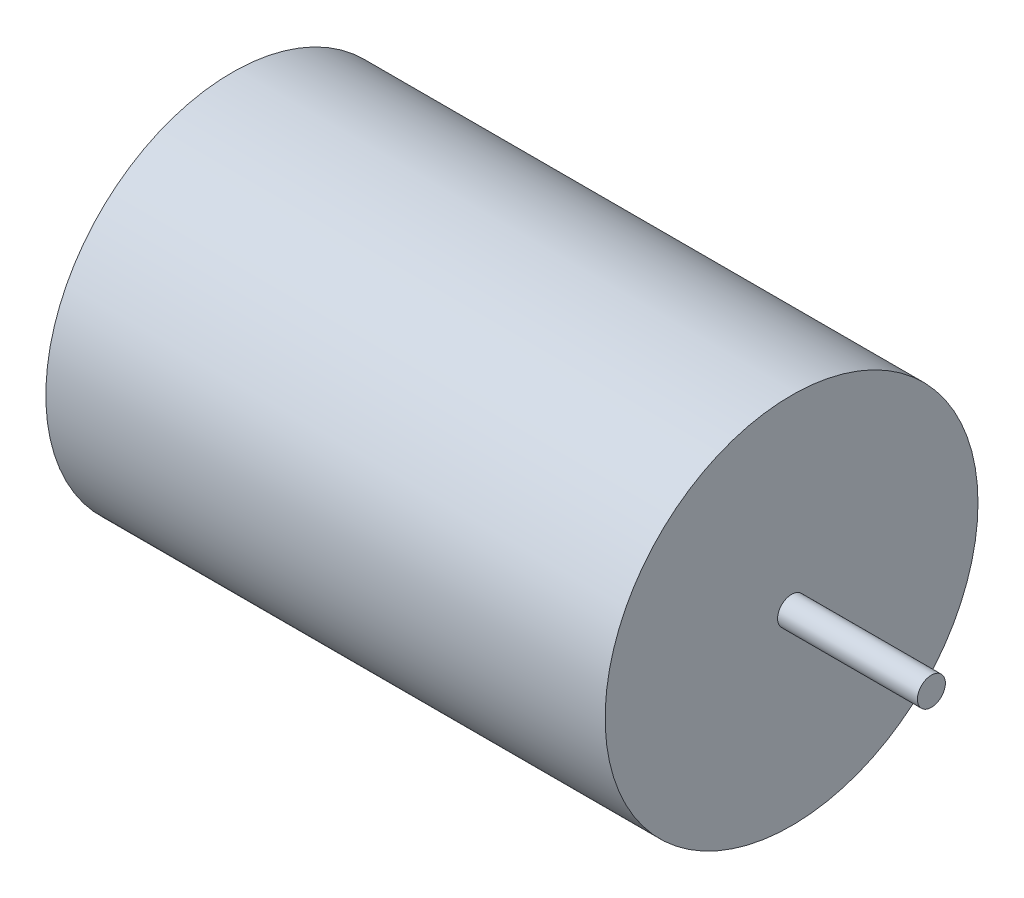
ISO-10303-21;
HEADER;
FILE_DESCRIPTION(('STEP AP214'),'2;1');
FILE_NAME('part.step','',(''),(''),'','','');
FILE_SCHEMA(('AUTOMOTIVE_DESIGN { 1 0 10303 214 1 1 1 1 }'));
ENDSEC;
DATA;
#1=APPLICATION_CONTEXT('core data for automotive mechanical design processes');
#2=APPLICATION_PROTOCOL_DEFINITION('international standard','automotive_design',2000,#1);
#3=PRODUCT_CONTEXT('',#1,'mechanical');
#4=PRODUCT('Part','Part','',(#3));
#5=PRODUCT_RELATED_PRODUCT_CATEGORY('part','',(#4));
#6=PRODUCT_DEFINITION_FORMATION('','',#4);
#7=PRODUCT_DEFINITION_CONTEXT('part definition',#1,'design');
#8=PRODUCT_DEFINITION('design','',#6,#7);
#9=PRODUCT_DEFINITION_SHAPE('','',#8);
#10=(LENGTH_UNIT() NAMED_UNIT(*) SI_UNIT(.MILLI.,.METRE.));
#11=(NAMED_UNIT(*) PLANE_ANGLE_UNIT() SI_UNIT($,.RADIAN.));
#12=(NAMED_UNIT(*) SI_UNIT($,.STERADIAN.) SOLID_ANGLE_UNIT());
#13=UNCERTAINTY_MEASURE_WITH_UNIT(LENGTH_MEASURE(1.E-05),#10,'distance_accuracy_value','');
#14=(GEOMETRIC_REPRESENTATION_CONTEXT(3) GLOBAL_UNCERTAINTY_ASSIGNED_CONTEXT((#13)) GLOBAL_UNIT_ASSIGNED_CONTEXT((#10,
#11,#12)) REPRESENTATION_CONTEXT('',''));
#15=CARTESIAN_POINT('',(0.,0.,0.));
#16=DIRECTION('',(0.,0.,1.));
#17=DIRECTION('',(1.,0.,0.));
#18=AXIS2_PLACEMENT_3D('',#15,#16,#17);
#19=CARTESIAN_POINT('',(60.,0.,0.));
#20=DIRECTION('',(-1.,0.,0.));
#21=DIRECTION('',(0.,0.,1.));
#22=AXIS2_PLACEMENT_3D('',#19,#20,#21);
#23=CYLINDRICAL_SURFACE('',#22,20.);
#24=CARTESIAN_POINT('',(60.,0.,0.));
#25=DIRECTION('',(1.,0.,0.));
#26=DIRECTION('',(0.,0.,-1.));
#27=AXIS2_PLACEMENT_3D('',#24,#25,#26);
#28=CIRCLE('',#27,20.);
#29=CARTESIAN_POINT('',(60.,0.,-20.));
#30=VERTEX_POINT('',#29);
#31=EDGE_CURVE('E10',#30,#30,#28,.T.);
#32=ORIENTED_EDGE('',*,*,#31,.F.);
#33=EDGE_LOOP('',(#32));
#34=FACE_BOUND('',#33,.T.);
#35=CARTESIAN_POINT('',(0.,0.,0.));
#36=DIRECTION('',(1.,0.,0.));
#37=DIRECTION('',(0.,0.,-1.));
#38=AXIS2_PLACEMENT_3D('',#35,#36,#37);
#39=CIRCLE('',#38,20.);
#40=CARTESIAN_POINT('',(0.,0.,-20.));
#41=VERTEX_POINT('',#40);
#42=EDGE_CURVE('E34',#41,#41,#39,.T.);
#43=ORIENTED_EDGE('',*,*,#42,.T.);
#44=EDGE_LOOP('',(#43));
#45=FACE_BOUND('',#44,.T.);
#46=ADVANCED_FACE('F31',(#34,#45),#23,.T.);
#47=CARTESIAN_POINT('',(60.,0.,0.));
#48=DIRECTION('',(1.,0.,0.));
#49=DIRECTION('',(0.,0.,-1.));
#50=AXIS2_PLACEMENT_3D('',#47,#48,#49);
#51=PLANE('',#50);
#52=CARTESIAN_POINT('',(60.,0.,0.));
#53=DIRECTION('',(1.,0.,0.));
#54=DIRECTION('',(0.,0.,-1.));
#55=AXIS2_PLACEMENT_3D('',#52,#53,#54);
#56=CIRCLE('',#55,1.5);
#57=CARTESIAN_POINT('',(60.,0.,-1.5));
#58=VERTEX_POINT('',#57);
#59=EDGE_CURVE('E43',#58,#58,#56,.T.);
#60=ORIENTED_EDGE('',*,*,#59,.F.);
#61=EDGE_LOOP('',(#60));
#62=FACE_BOUND('',#61,.T.);
#63=ORIENTED_EDGE('',*,*,#31,.T.);
#64=EDGE_LOOP('',(#63));
#65=FACE_BOUND('',#64,.T.);
#66=ADVANCED_FACE('F58',(#62,#65),#51,.T.);
#67=CARTESIAN_POINT('',(0.,0.,0.));
#68=DIRECTION('',(1.,0.,0.));
#69=DIRECTION('',(0.,0.,-1.));
#70=AXIS2_PLACEMENT_3D('',#67,#68,#69);
#71=PLANE('',#70);
#72=ORIENTED_EDGE('',*,*,#42,.F.);
#73=EDGE_LOOP('',(#72));
#74=FACE_BOUND('',#73,.T.);
#75=ADVANCED_FACE('F54',(#74),#71,.F.);
#76=CARTESIAN_POINT('',(75.,0.,0.));
#77=DIRECTION('',(-1.,0.,0.));
#78=DIRECTION('',(0.,0.,1.));
#79=AXIS2_PLACEMENT_3D('',#76,#77,#78);
#80=CYLINDRICAL_SURFACE('',#79,1.5);
#81=CARTESIAN_POINT('',(75.,0.,0.));
#82=DIRECTION('',(1.,0.,0.));
#83=DIRECTION('',(0.,0.,-1.));
#84=AXIS2_PLACEMENT_3D('',#81,#82,#83);
#85=CIRCLE('',#84,1.5);
#86=CARTESIAN_POINT('',(75.,0.,-1.5));
#87=VERTEX_POINT('',#86);
#88=EDGE_CURVE('E41',#87,#87,#85,.T.);
#89=ORIENTED_EDGE('',*,*,#88,.F.);
#90=EDGE_LOOP('',(#89));
#91=FACE_BOUND('',#90,.T.);
#92=ORIENTED_EDGE('',*,*,#59,.T.);
#93=EDGE_LOOP('',(#92));
#94=FACE_BOUND('',#93,.T.);
#95=ADVANCED_FACE('F51',(#91,#94),#80,.T.);
#96=CARTESIAN_POINT('',(75.,0.,0.));
#97=DIRECTION('',(1.,0.,0.));
#98=DIRECTION('',(0.,0.,-1.));
#99=AXIS2_PLACEMENT_3D('',#96,#97,#98);
#100=PLANE('',#99);
#101=ORIENTED_EDGE('',*,*,#88,.T.);
#102=EDGE_LOOP('',(#101));
#103=FACE_BOUND('',#102,.T.);
#104=ADVANCED_FACE('F49',(#103),#100,.T.);
#105=CLOSED_SHELL('',(#46,#66,#75,#95,#104));
#106=MANIFOLD_SOLID_BREP('B2',#105);
#107=ADVANCED_BREP_SHAPE_REPRESENTATION('',(#18,#106),#14);
#108=SHAPE_DEFINITION_REPRESENTATION(#9,#107);
ENDSEC;
END-ISO-10303-21;
